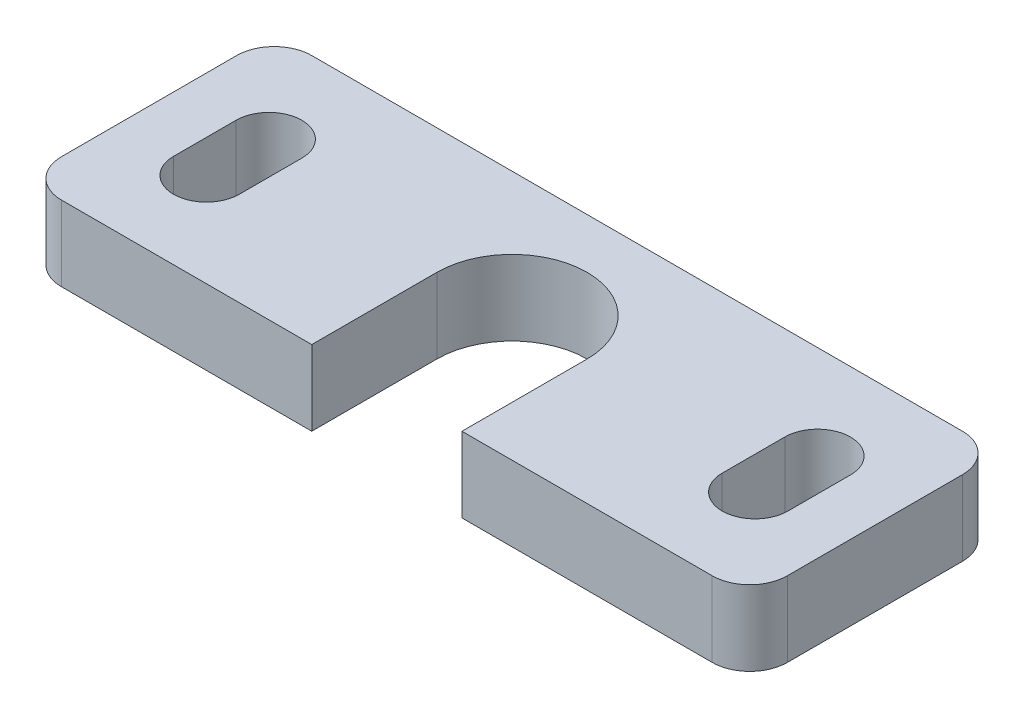
ISO-10303-21;
HEADER;
FILE_DESCRIPTION(('STEP AP214'),'2;1');
FILE_NAME('part.step','',(''),(''),'','','');
FILE_SCHEMA(('AUTOMOTIVE_DESIGN { 1 0 10303 214 1 1 1 1 }'));
ENDSEC;
DATA;
#1=APPLICATION_CONTEXT('core data for automotive mechanical design processes');
#2=APPLICATION_PROTOCOL_DEFINITION('international standard','automotive_design',2000,#1);
#3=PRODUCT_CONTEXT('',#1,'mechanical');
#4=PRODUCT('Part','Part','',(#3));
#5=PRODUCT_RELATED_PRODUCT_CATEGORY('part','',(#4));
#6=PRODUCT_DEFINITION_FORMATION('','',#4);
#7=PRODUCT_DEFINITION_CONTEXT('part definition',#1,'design');
#8=PRODUCT_DEFINITION('design','',#6,#7);
#9=PRODUCT_DEFINITION_SHAPE('','',#8);
#10=(LENGTH_UNIT() NAMED_UNIT(*) SI_UNIT(.MILLI.,.METRE.));
#11=(NAMED_UNIT(*) PLANE_ANGLE_UNIT() SI_UNIT($,.RADIAN.));
#12=(NAMED_UNIT(*) SI_UNIT($,.STERADIAN.) SOLID_ANGLE_UNIT());
#13=UNCERTAINTY_MEASURE_WITH_UNIT(LENGTH_MEASURE(1.E-05),#10,'distance_accuracy_value','');
#14=(GEOMETRIC_REPRESENTATION_CONTEXT(3) GLOBAL_UNCERTAINTY_ASSIGNED_CONTEXT((#13)) GLOBAL_UNIT_ASSIGNED_CONTEXT((#10,
#11,#12)) REPRESENTATION_CONTEXT('',''));
#15=CARTESIAN_POINT('',(0.,0.,0.));
#16=DIRECTION('',(0.,0.,1.));
#17=DIRECTION('',(1.,0.,0.));
#18=AXIS2_PLACEMENT_3D('',#15,#16,#17);
#19=CARTESIAN_POINT('',(29.,6.,-10.));
#20=DIRECTION('',(0.,-1.,0.));
#21=DIRECTION('',(0.,0.,-1.));
#22=AXIS2_PLACEMENT_3D('',#19,#20,#21);
#23=PLANE('',#22);
#24=CARTESIAN_POINT('',(7.08,6.,-12.5));
#25=DIRECTION('',(0.,1.,0.));
#26=DIRECTION('',(0.,0.,1.));
#27=AXIS2_PLACEMENT_3D('',#24,#25,#26);
#28=CIRCLE('',#27,2.62499999999999);
#29=CARTESIAN_POINT('',(9.70499999999999,6.,-12.5));
#30=VERTEX_POINT('',#29);
#31=CARTESIAN_POINT('',(4.45500000000001,6.,-12.5));
#32=VERTEX_POINT('',#31);
#33=EDGE_CURVE('E213',#30,#32,#28,.T.);
#34=ORIENTED_EDGE('',*,*,#33,.F.);
#35=DIRECTION('',(0.,0.,-1.));
#36=VECTOR('',#35,1.);
#37=CARTESIAN_POINT('',(9.70499999999999,6.,-12.5));
#38=LINE('',#37,#36);
#39=CARTESIAN_POINT('',(9.70499999999999,6.,-7.5));
#40=VERTEX_POINT('',#39);
#41=EDGE_CURVE('E221',#40,#30,#38,.T.);
#42=ORIENTED_EDGE('',*,*,#41,.F.);
#43=CARTESIAN_POINT('',(7.08,6.,-7.5));
#44=DIRECTION('',(0.,1.,0.));
#45=DIRECTION('',(0.,0.,1.));
#46=AXIS2_PLACEMENT_3D('',#43,#44,#45);
#47=CIRCLE('',#46,2.62499999999999);
#48=CARTESIAN_POINT('',(4.45500000000001,6.,-7.50000000000001));
#49=VERTEX_POINT('',#48);
#50=EDGE_CURVE('E218',#49,#40,#47,.T.);
#51=ORIENTED_EDGE('',*,*,#50,.F.);
#52=DIRECTION('',(0.,0.,1.));
#53=VECTOR('',#52,1.);
#54=CARTESIAN_POINT('',(4.45500000000001,6.,-12.5));
#55=LINE('',#54,#53);
#56=EDGE_CURVE('E215',#32,#49,#55,.T.);
#57=ORIENTED_EDGE('',*,*,#56,.F.);
#58=EDGE_LOOP('',(#34,#42,#51,#57));
#59=FACE_BOUND('',#58,.T.);
#60=DIRECTION('',(-1.,0.,0.));
#61=VECTOR('',#60,1.);
#62=CARTESIAN_POINT('',(0.,6.,-20.));
#63=LINE('',#62,#61);
#64=CARTESIAN_POINT('',(55.,6.,-20.));
#65=VERTEX_POINT('',#64);
#66=CARTESIAN_POINT('',(3.,6.,-20.));
#67=VERTEX_POINT('',#66);
#68=EDGE_CURVE('E260',#65,#67,#63,.T.);
#69=ORIENTED_EDGE('',*,*,#68,.T.);
#70=CARTESIAN_POINT('',(3.,6.,-17.));
#71=DIRECTION('',(0.,-1.,0.));
#72=DIRECTION('',(0.,0.,-1.));
#73=AXIS2_PLACEMENT_3D('',#70,#71,#72);
#74=CIRCLE('',#73,3.);
#75=CARTESIAN_POINT('',(0.,6.,-17.));
#76=VERTEX_POINT('',#75);
#77=EDGE_CURVE('E315',#67,#76,#74,.F.);
#78=ORIENTED_EDGE('',*,*,#77,.T.);
#79=DIRECTION('',(0.,0.,1.));
#80=VECTOR('',#79,1.);
#81=CARTESIAN_POINT('',(0.,6.,0.));
#82=LINE('',#81,#80);
#83=CARTESIAN_POINT('',(0.,6.,-3.));
#84=VERTEX_POINT('',#83);
#85=EDGE_CURVE('E244',#76,#84,#82,.T.);
#86=ORIENTED_EDGE('',*,*,#85,.T.);
#87=CARTESIAN_POINT('',(3.,6.,-3.));
#88=DIRECTION('',(0.,-1.,0.));
#89=DIRECTION('',(0.,0.,-1.));
#90=AXIS2_PLACEMENT_3D('',#87,#88,#89);
#91=CIRCLE('',#90,3.);
#92=CARTESIAN_POINT('',(3.,6.,0.));
#93=VERTEX_POINT('',#92);
#94=EDGE_CURVE('E313',#84,#93,#91,.F.);
#95=ORIENTED_EDGE('',*,*,#94,.T.);
#96=DIRECTION('',(1.,0.,0.));
#97=VECTOR('',#96,1.);
#98=CARTESIAN_POINT('',(0.,6.,0.));
#99=LINE('',#98,#97);
#100=CARTESIAN_POINT('',(23.,6.,0.));
#101=VERTEX_POINT('',#100);
#102=EDGE_CURVE('E247',#93,#101,#99,.T.);
#103=ORIENTED_EDGE('',*,*,#102,.T.);
#104=DIRECTION('',(0.,0.,-1.));
#105=VECTOR('',#104,1.);
#106=CARTESIAN_POINT('',(23.,6.,0.));
#107=LINE('',#106,#105);
#108=CARTESIAN_POINT('',(23.,6.,-10.));
#109=VERTEX_POINT('',#108);
#110=EDGE_CURVE('E250',#101,#109,#107,.T.);
#111=ORIENTED_EDGE('',*,*,#110,.T.);
#112=CARTESIAN_POINT('',(29.,6.,-10.));
#113=DIRECTION('',(0.,-1.,0.));
#114=DIRECTION('',(0.,0.,-1.));
#115=AXIS2_PLACEMENT_3D('',#112,#113,#114);
#116=CIRCLE('',#115,6.);
#117=CARTESIAN_POINT('',(35.,6.,-10.));
#118=VERTEX_POINT('',#117);
#119=EDGE_CURVE('E252',#109,#118,#116,.T.);
#120=ORIENTED_EDGE('',*,*,#119,.T.);
#121=DIRECTION('',(0.,0.,1.));
#122=VECTOR('',#121,1.);
#123=CARTESIAN_POINT('',(35.,6.,-10.));
#124=LINE('',#123,#122);
#125=CARTESIAN_POINT('',(35.,6.,0.));
#126=VERTEX_POINT('',#125);
#127=EDGE_CURVE('E254',#118,#126,#124,.T.);
#128=ORIENTED_EDGE('',*,*,#127,.T.);
#129=DIRECTION('',(1.,0.,0.));
#130=VECTOR('',#129,1.);
#131=CARTESIAN_POINT('',(35.,6.,0.));
#132=LINE('',#131,#130);
#133=CARTESIAN_POINT('',(55.,6.,0.));
#134=VERTEX_POINT('',#133);
#135=EDGE_CURVE('E256',#126,#134,#132,.T.);
#136=ORIENTED_EDGE('',*,*,#135,.T.);
#137=CARTESIAN_POINT('',(55.,6.,-3.));
#138=DIRECTION('',(0.,-1.,0.));
#139=DIRECTION('',(0.,0.,-1.));
#140=AXIS2_PLACEMENT_3D('',#137,#138,#139);
#141=CIRCLE('',#140,3.);
#142=CARTESIAN_POINT('',(58.,6.,-3.));
#143=VERTEX_POINT('',#142);
#144=EDGE_CURVE('E55',#134,#143,#141,.F.);
#145=ORIENTED_EDGE('',*,*,#144,.T.);
#146=DIRECTION('',(0.,0.,-1.));
#147=VECTOR('',#146,1.);
#148=CARTESIAN_POINT('',(58.,6.,0.));
#149=LINE('',#148,#147);
#150=CARTESIAN_POINT('',(58.,6.,-17.));
#151=VERTEX_POINT('',#150);
#152=EDGE_CURVE('E258',#143,#151,#149,.T.);
#153=ORIENTED_EDGE('',*,*,#152,.T.);
#154=CARTESIAN_POINT('',(55.,6.,-17.));
#155=DIRECTION('',(0.,-1.,0.));
#156=DIRECTION('',(0.,0.,-1.));
#157=AXIS2_PLACEMENT_3D('',#154,#155,#156);
#158=CIRCLE('',#157,3.);
#159=EDGE_CURVE('E310',#151,#65,#158,.F.);
#160=ORIENTED_EDGE('',*,*,#159,.T.);
#161=EDGE_LOOP('',(#69,#78,#86,#95,#103,#111,#120,#128,#136,#145,#153,#160));
#162=FACE_BOUND('',#161,.T.);
#163=CARTESIAN_POINT('',(50.92,6.,-12.5));
#164=DIRECTION('',(0.,1.,0.));
#165=DIRECTION('',(0.,0.,-1.));
#166=AXIS2_PLACEMENT_3D('',#163,#164,#165);
#167=CIRCLE('',#166,2.62499999999999);
#168=CARTESIAN_POINT('',(53.545,6.,-12.5));
#169=VERTEX_POINT('',#168);
#170=CARTESIAN_POINT('',(48.295,6.,-12.5));
#171=VERTEX_POINT('',#170);
#172=EDGE_CURVE('E172',#169,#171,#167,.T.);
#173=ORIENTED_EDGE('',*,*,#172,.F.);
#174=DIRECTION('',(0.,0.,-1.));
#175=VECTOR('',#174,1.);
#176=CARTESIAN_POINT('',(53.545,6.,-12.5));
#177=LINE('',#176,#175);
#178=CARTESIAN_POINT('',(53.545,6.,-7.50000000000002));
#179=VERTEX_POINT('',#178);
#180=EDGE_CURVE('E197',#179,#169,#177,.T.);
#181=ORIENTED_EDGE('',*,*,#180,.F.);
#182=CARTESIAN_POINT('',(50.92,6.,-7.50000000000002));
#183=DIRECTION('',(0.,1.,0.));
#184=DIRECTION('',(0.,0.,-1.));
#185=AXIS2_PLACEMENT_3D('',#182,#183,#184);
#186=CIRCLE('',#185,2.62499999999999);
#187=CARTESIAN_POINT('',(48.295,6.,-7.50000000000002));
#188=VERTEX_POINT('',#187);
#189=EDGE_CURVE('E195',#188,#179,#186,.T.);
#190=ORIENTED_EDGE('',*,*,#189,.F.);
#191=DIRECTION('',(0.,0.,1.));
#192=VECTOR('',#191,1.);
#193=CARTESIAN_POINT('',(48.295,6.,-12.5));
#194=LINE('',#193,#192);
#195=EDGE_CURVE('E182',#171,#188,#194,.T.);
#196=ORIENTED_EDGE('',*,*,#195,.F.);
#197=EDGE_LOOP('',(#173,#181,#190,#196));
#198=FACE_BOUND('',#197,.T.);
#199=ADVANCED_FACE('F33',(#59,#162,#198),#23,.F.);
#200=CARTESIAN_POINT('',(29.,0.,-10.));
#201=DIRECTION('',(0.,-1.,0.));
#202=DIRECTION('',(0.,0.,-1.));
#203=AXIS2_PLACEMENT_3D('',#200,#201,#202);
#204=PLANE('',#203);
#205=DIRECTION('',(0.,0.,1.));
#206=VECTOR('',#205,1.);
#207=CARTESIAN_POINT('',(0.,0.,0.));
#208=LINE('',#207,#206);
#209=CARTESIAN_POINT('',(0.,0.,-17.));
#210=VERTEX_POINT('',#209);
#211=CARTESIAN_POINT('',(0.,0.,-3.));
#212=VERTEX_POINT('',#211);
#213=EDGE_CURVE('E243',#210,#212,#208,.T.);
#214=ORIENTED_EDGE('',*,*,#213,.F.);
#215=CARTESIAN_POINT('',(3.,0.,-17.));
#216=DIRECTION('',(0.,-1.,0.));
#217=DIRECTION('',(0.,0.,-1.));
#218=AXIS2_PLACEMENT_3D('',#215,#216,#217);
#219=CIRCLE('',#218,3.);
#220=CARTESIAN_POINT('',(3.,0.,-20.));
#221=VERTEX_POINT('',#220);
#222=EDGE_CURVE('E303',#210,#221,#219,.T.);
#223=ORIENTED_EDGE('',*,*,#222,.T.);
#224=DIRECTION('',(-1.,0.,0.));
#225=VECTOR('',#224,1.);
#226=CARTESIAN_POINT('',(0.,0.,-20.));
#227=LINE('',#226,#225);
#228=CARTESIAN_POINT('',(55.,0.,-20.));
#229=VERTEX_POINT('',#228);
#230=EDGE_CURVE('E248',#229,#221,#227,.T.);
#231=ORIENTED_EDGE('',*,*,#230,.F.);
#232=CARTESIAN_POINT('',(55.,0.,-17.));
#233=DIRECTION('',(0.,-1.,0.));
#234=DIRECTION('',(0.,0.,-1.));
#235=AXIS2_PLACEMENT_3D('',#232,#233,#234);
#236=CIRCLE('',#235,3.);
#237=CARTESIAN_POINT('',(58.,0.,-17.));
#238=VERTEX_POINT('',#237);
#239=EDGE_CURVE('E297',#229,#238,#236,.T.);
#240=ORIENTED_EDGE('',*,*,#239,.T.);
#241=DIRECTION('',(0.,0.,-1.));
#242=VECTOR('',#241,1.);
#243=CARTESIAN_POINT('',(58.,0.,0.));
#244=LINE('',#243,#242);
#245=CARTESIAN_POINT('',(58.,0.,-3.));
#246=VERTEX_POINT('',#245);
#247=EDGE_CURVE('E277',#246,#238,#244,.T.);
#248=ORIENTED_EDGE('',*,*,#247,.F.);
#249=CARTESIAN_POINT('',(55.,0.,-3.));
#250=DIRECTION('',(0.,-1.,0.));
#251=DIRECTION('',(0.,0.,-1.));
#252=AXIS2_PLACEMENT_3D('',#249,#250,#251);
#253=CIRCLE('',#252,3.);
#254=CARTESIAN_POINT('',(55.,0.,0.));
#255=VERTEX_POINT('',#254);
#256=EDGE_CURVE('E299',#246,#255,#253,.T.);
#257=ORIENTED_EDGE('',*,*,#256,.T.);
#258=DIRECTION('',(1.,0.,0.));
#259=VECTOR('',#258,1.);
#260=CARTESIAN_POINT('',(35.,0.,0.));
#261=LINE('',#260,#259);
#262=CARTESIAN_POINT('',(35.,0.,0.));
#263=VERTEX_POINT('',#262);
#264=EDGE_CURVE('E274',#263,#255,#261,.T.);
#265=ORIENTED_EDGE('',*,*,#264,.F.);
#266=DIRECTION('',(0.,0.,1.));
#267=VECTOR('',#266,1.);
#268=CARTESIAN_POINT('',(35.,0.,-10.));
#269=LINE('',#268,#267);
#270=CARTESIAN_POINT('',(35.,0.,-10.));
#271=VERTEX_POINT('',#270);
#272=EDGE_CURVE('E272',#271,#263,#269,.T.);
#273=ORIENTED_EDGE('',*,*,#272,.F.);
#274=CARTESIAN_POINT('',(29.,0.,-10.));
#275=DIRECTION('',(0.,-1.,0.));
#276=DIRECTION('',(0.,0.,-1.));
#277=AXIS2_PLACEMENT_3D('',#274,#275,#276);
#278=CIRCLE('',#277,6.);
#279=CARTESIAN_POINT('',(23.,0.,-10.));
#280=VERTEX_POINT('',#279);
#281=EDGE_CURVE('E270',#280,#271,#278,.T.);
#282=ORIENTED_EDGE('',*,*,#281,.F.);
#283=DIRECTION('',(0.,0.,-1.));
#284=VECTOR('',#283,1.);
#285=CARTESIAN_POINT('',(23.,0.,0.));
#286=LINE('',#285,#284);
#287=CARTESIAN_POINT('',(23.,0.,0.));
#288=VERTEX_POINT('',#287);
#289=EDGE_CURVE('E268',#288,#280,#286,.T.);
#290=ORIENTED_EDGE('',*,*,#289,.F.);
#291=DIRECTION('',(1.,0.,0.));
#292=VECTOR('',#291,1.);
#293=CARTESIAN_POINT('',(0.,0.,0.));
#294=LINE('',#293,#292);
#295=CARTESIAN_POINT('',(3.,0.,0.));
#296=VERTEX_POINT('',#295);
#297=EDGE_CURVE('E266',#296,#288,#294,.T.);
#298=ORIENTED_EDGE('',*,*,#297,.F.);
#299=CARTESIAN_POINT('',(3.,0.,-3.));
#300=DIRECTION('',(0.,-1.,0.));
#301=DIRECTION('',(0.,0.,-1.));
#302=AXIS2_PLACEMENT_3D('',#299,#300,#301);
#303=CIRCLE('',#302,3.);
#304=EDGE_CURVE('E301',#296,#212,#303,.T.);
#305=ORIENTED_EDGE('',*,*,#304,.T.);
#306=EDGE_LOOP('',(#214,#223,#231,#240,#248,#257,#265,#273,#282,#290,#298,#305));
#307=FACE_BOUND('',#306,.T.);
#308=DIRECTION('',(0.,0.,-1.));
#309=VECTOR('',#308,1.);
#310=CARTESIAN_POINT('',(9.70499999999999,0.,-12.5));
#311=LINE('',#310,#309);
#312=CARTESIAN_POINT('',(9.70499999999999,0.,-7.5));
#313=VERTEX_POINT('',#312);
#314=CARTESIAN_POINT('',(9.70499999999999,0.,-12.5));
#315=VERTEX_POINT('',#314);
#316=EDGE_CURVE('E216',#313,#315,#311,.T.);
#317=ORIENTED_EDGE('',*,*,#316,.T.);
#318=CARTESIAN_POINT('',(7.08,0.,-12.5));
#319=DIRECTION('',(0.,1.,0.));
#320=DIRECTION('',(0.,0.,1.));
#321=AXIS2_PLACEMENT_3D('',#318,#319,#320);
#322=CIRCLE('',#321,2.62499999999999);
#323=CARTESIAN_POINT('',(4.45500000000001,0.,-12.5));
#324=VERTEX_POINT('',#323);
#325=EDGE_CURVE('E190',#315,#324,#322,.T.);
#326=ORIENTED_EDGE('',*,*,#325,.T.);
#327=DIRECTION('',(0.,0.,1.));
#328=VECTOR('',#327,1.);
#329=CARTESIAN_POINT('',(4.45500000000001,0.,-12.5));
#330=LINE('',#329,#328);
#331=CARTESIAN_POINT('',(4.45500000000001,0.,-7.50000000000001));
#332=VERTEX_POINT('',#331);
#333=EDGE_CURVE('E226',#324,#332,#330,.T.);
#334=ORIENTED_EDGE('',*,*,#333,.T.);
#335=CARTESIAN_POINT('',(7.08,0.,-7.5));
#336=DIRECTION('',(0.,1.,0.));
#337=DIRECTION('',(0.,0.,1.));
#338=AXIS2_PLACEMENT_3D('',#335,#336,#337);
#339=CIRCLE('',#338,2.62499999999999);
#340=EDGE_CURVE('E229',#332,#313,#339,.T.);
#341=ORIENTED_EDGE('',*,*,#340,.T.);
#342=EDGE_LOOP('',(#317,#326,#334,#341));
#343=FACE_BOUND('',#342,.T.);
#344=DIRECTION('',(0.,0.,-1.));
#345=VECTOR('',#344,1.);
#346=CARTESIAN_POINT('',(53.545,0.,-12.5));
#347=LINE('',#346,#345);
#348=CARTESIAN_POINT('',(53.545,0.,-7.50000000000002));
#349=VERTEX_POINT('',#348);
#350=CARTESIAN_POINT('',(53.545,0.,-12.5));
#351=VERTEX_POINT('',#350);
#352=EDGE_CURVE('E183',#349,#351,#347,.T.);
#353=ORIENTED_EDGE('',*,*,#352,.T.);
#354=CARTESIAN_POINT('',(50.92,0.,-12.5));
#355=DIRECTION('',(0.,1.,0.));
#356=DIRECTION('',(0.,0.,-1.));
#357=AXIS2_PLACEMENT_3D('',#354,#355,#356);
#358=CIRCLE('',#357,2.62499999999999);
#359=CARTESIAN_POINT('',(48.295,0.,-12.5));
#360=VERTEX_POINT('',#359);
#361=EDGE_CURVE('E201',#351,#360,#358,.T.);
#362=ORIENTED_EDGE('',*,*,#361,.T.);
#363=DIRECTION('',(0.,0.,1.));
#364=VECTOR('',#363,1.);
#365=CARTESIAN_POINT('',(48.295,0.,-12.5));
#366=LINE('',#365,#364);
#367=CARTESIAN_POINT('',(48.295,0.,-7.50000000000002));
#368=VERTEX_POINT('',#367);
#369=EDGE_CURVE('E189',#360,#368,#366,.T.);
#370=ORIENTED_EDGE('',*,*,#369,.T.);
#371=CARTESIAN_POINT('',(50.92,0.,-7.50000000000002));
#372=DIRECTION('',(0.,1.,0.));
#373=DIRECTION('',(0.,0.,-1.));
#374=AXIS2_PLACEMENT_3D('',#371,#372,#373);
#375=CIRCLE('',#374,2.62499999999999);
#376=EDGE_CURVE('E204',#368,#349,#375,.T.);
#377=ORIENTED_EDGE('',*,*,#376,.T.);
#378=EDGE_LOOP('',(#353,#362,#370,#377));
#379=FACE_BOUND('',#378,.T.);
#380=ADVANCED_FACE('F327',(#307,#343,#379),#204,.T.);
#381=CARTESIAN_POINT('',(0.,6.,0.));
#382=DIRECTION('',(1.,0.,0.));
#383=DIRECTION('',(0.,0.,-1.));
#384=AXIS2_PLACEMENT_3D('',#381,#382,#383);
#385=PLANE('',#384);
#386=ORIENTED_EDGE('',*,*,#85,.F.);
#387=DIRECTION('',(0.,-1.,0.));
#388=VECTOR('',#387,1.);
#389=CARTESIAN_POINT('',(0.,6.,-17.));
#390=LINE('',#389,#388);
#391=EDGE_CURVE('E294',#76,#210,#390,.T.);
#392=ORIENTED_EDGE('',*,*,#391,.T.);
#393=ORIENTED_EDGE('',*,*,#213,.T.);
#394=DIRECTION('',(0.,-1.,0.));
#395=VECTOR('',#394,1.);
#396=CARTESIAN_POINT('',(0.,6.,-3.));
#397=LINE('',#396,#395);
#398=EDGE_CURVE('E292',#212,#84,#397,.F.);
#399=ORIENTED_EDGE('',*,*,#398,.T.);
#400=EDGE_LOOP('',(#386,#392,#393,#399));
#401=FACE_BOUND('',#400,.T.);
#402=ADVANCED_FACE('F344',(#401),#385,.F.);
#403=CARTESIAN_POINT('',(0.,6.,0.));
#404=DIRECTION('',(0.,0.,-1.));
#405=DIRECTION('',(-1.,0.,0.));
#406=AXIS2_PLACEMENT_3D('',#403,#404,#405);
#407=PLANE('',#406);
#408=ORIENTED_EDGE('',*,*,#102,.F.);
#409=DIRECTION('',(0.,-1.,0.));
#410=VECTOR('',#409,1.);
#411=CARTESIAN_POINT('',(3.,6.,0.));
#412=LINE('',#411,#410);
#413=EDGE_CURVE('E317',#93,#296,#412,.T.);
#414=ORIENTED_EDGE('',*,*,#413,.T.);
#415=ORIENTED_EDGE('',*,*,#297,.T.);
#416=DIRECTION('',(0.,-1.,0.));
#417=VECTOR('',#416,1.);
#418=CARTESIAN_POINT('',(23.,6.,0.));
#419=LINE('',#418,#417);
#420=EDGE_CURVE('E289',#101,#288,#419,.T.);
#421=ORIENTED_EDGE('',*,*,#420,.F.);
#422=EDGE_LOOP('',(#408,#414,#415,#421));
#423=FACE_BOUND('',#422,.T.);
#424=ADVANCED_FACE('F354',(#423),#407,.F.);
#425=CARTESIAN_POINT('',(23.,6.,0.));
#426=DIRECTION('',(-1.,0.,0.));
#427=DIRECTION('',(0.,0.,1.));
#428=AXIS2_PLACEMENT_3D('',#425,#426,#427);
#429=PLANE('',#428);
#430=ORIENTED_EDGE('',*,*,#289,.T.);
#431=DIRECTION('',(0.,-1.,0.));
#432=VECTOR('',#431,1.);
#433=CARTESIAN_POINT('',(23.,6.,-10.));
#434=LINE('',#433,#432);
#435=EDGE_CURVE('E286',#109,#280,#434,.T.);
#436=ORIENTED_EDGE('',*,*,#435,.F.);
#437=ORIENTED_EDGE('',*,*,#110,.F.);
#438=ORIENTED_EDGE('',*,*,#420,.T.);
#439=EDGE_LOOP('',(#430,#436,#437,#438));
#440=FACE_BOUND('',#439,.T.);
#441=ADVANCED_FACE('F361',(#440),#429,.F.);
#442=CARTESIAN_POINT('',(29.,6.,-10.));
#443=DIRECTION('',(0.,-1.,0.));
#444=DIRECTION('',(0.,0.,-1.));
#445=AXIS2_PLACEMENT_3D('',#442,#443,#444);
#446=CYLINDRICAL_SURFACE('',#445,6.);
#447=ORIENTED_EDGE('',*,*,#281,.T.);
#448=DIRECTION('',(0.,-1.,0.));
#449=VECTOR('',#448,1.);
#450=CARTESIAN_POINT('',(35.,6.,-10.));
#451=LINE('',#450,#449);
#452=EDGE_CURVE('E283',#118,#271,#451,.T.);
#453=ORIENTED_EDGE('',*,*,#452,.F.);
#454=ORIENTED_EDGE('',*,*,#119,.F.);
#455=ORIENTED_EDGE('',*,*,#435,.T.);
#456=EDGE_LOOP('',(#447,#453,#454,#455));
#457=FACE_BOUND('',#456,.T.);
#458=ADVANCED_FACE('F364',(#457),#446,.F.);
#459=CARTESIAN_POINT('',(35.,6.,-10.));
#460=DIRECTION('',(1.,0.,0.));
#461=DIRECTION('',(0.,0.,-1.));
#462=AXIS2_PLACEMENT_3D('',#459,#460,#461);
#463=PLANE('',#462);
#464=ORIENTED_EDGE('',*,*,#272,.T.);
#465=DIRECTION('',(0.,-1.,0.));
#466=VECTOR('',#465,1.);
#467=CARTESIAN_POINT('',(35.,6.,0.));
#468=LINE('',#467,#466);
#469=EDGE_CURVE('E263',#126,#263,#468,.T.);
#470=ORIENTED_EDGE('',*,*,#469,.F.);
#471=ORIENTED_EDGE('',*,*,#127,.F.);
#472=ORIENTED_EDGE('',*,*,#452,.T.);
#473=EDGE_LOOP('',(#464,#470,#471,#472));
#474=FACE_BOUND('',#473,.T.);
#475=ADVANCED_FACE('F369',(#474),#463,.F.);
#476=CARTESIAN_POINT('',(35.,6.,0.));
#477=DIRECTION('',(0.,0.,-1.));
#478=DIRECTION('',(-1.,0.,0.));
#479=AXIS2_PLACEMENT_3D('',#476,#477,#478);
#480=PLANE('',#479);
#481=ORIENTED_EDGE('',*,*,#264,.T.);
#482=DIRECTION('',(0.,-1.,0.));
#483=VECTOR('',#482,1.);
#484=CARTESIAN_POINT('',(55.,6.,0.));
#485=LINE('',#484,#483);
#486=EDGE_CURVE('E11',#255,#134,#485,.F.);
#487=ORIENTED_EDGE('',*,*,#486,.T.);
#488=ORIENTED_EDGE('',*,*,#135,.F.);
#489=ORIENTED_EDGE('',*,*,#469,.T.);
#490=EDGE_LOOP('',(#481,#487,#488,#489));
#491=FACE_BOUND('',#490,.T.);
#492=ADVANCED_FACE('F374',(#491),#480,.F.);
#493=CARTESIAN_POINT('',(58.,6.,0.));
#494=DIRECTION('',(-1.,0.,0.));
#495=DIRECTION('',(0.,0.,1.));
#496=AXIS2_PLACEMENT_3D('',#493,#494,#495);
#497=PLANE('',#496);
#498=ORIENTED_EDGE('',*,*,#152,.F.);
#499=DIRECTION('',(0.,-1.,0.));
#500=VECTOR('',#499,1.);
#501=CARTESIAN_POINT('',(58.,6.,-3.));
#502=LINE('',#501,#500);
#503=EDGE_CURVE('E41',#143,#246,#502,.T.);
#504=ORIENTED_EDGE('',*,*,#503,.T.);
#505=ORIENTED_EDGE('',*,*,#247,.T.);
#506=DIRECTION('',(0.,-1.,0.));
#507=VECTOR('',#506,1.);
#508=CARTESIAN_POINT('',(58.,6.,-17.));
#509=LINE('',#508,#507);
#510=EDGE_CURVE('E48',#238,#151,#509,.F.);
#511=ORIENTED_EDGE('',*,*,#510,.T.);
#512=EDGE_LOOP('',(#498,#504,#505,#511));
#513=FACE_BOUND('',#512,.T.);
#514=ADVANCED_FACE('F323',(#513),#497,.F.);
#515=CARTESIAN_POINT('',(0.,6.,-20.));
#516=DIRECTION('',(0.,0.,1.));
#517=DIRECTION('',(1.,0.,0.));
#518=AXIS2_PLACEMENT_3D('',#515,#516,#517);
#519=PLANE('',#518);
#520=ORIENTED_EDGE('',*,*,#230,.T.);
#521=DIRECTION('',(0.,-1.,0.));
#522=VECTOR('',#521,1.);
#523=CARTESIAN_POINT('',(3.,6.,-20.));
#524=LINE('',#523,#522);
#525=EDGE_CURVE('E308',#221,#67,#524,.F.);
#526=ORIENTED_EDGE('',*,*,#525,.T.);
#527=ORIENTED_EDGE('',*,*,#68,.F.);
#528=DIRECTION('',(0.,-1.,0.));
#529=VECTOR('',#528,1.);
#530=CARTESIAN_POINT('',(55.,6.,-20.));
#531=LINE('',#530,#529);
#532=EDGE_CURVE('E305',#65,#229,#531,.T.);
#533=ORIENTED_EDGE('',*,*,#532,.T.);
#534=EDGE_LOOP('',(#520,#526,#527,#533));
#535=FACE_BOUND('',#534,.T.);
#536=ADVANCED_FACE('F336',(#535),#519,.F.);
#537=CARTESIAN_POINT('',(7.08,6.,-12.5));
#538=DIRECTION('',(0.,-1.,0.));
#539=DIRECTION('',(0.,0.,-1.));
#540=AXIS2_PLACEMENT_3D('',#537,#538,#539);
#541=CYLINDRICAL_SURFACE('',#540,2.62499999999999);
#542=ORIENTED_EDGE('',*,*,#325,.F.);
#543=DIRECTION('',(0.,-1.,0.));
#544=VECTOR('',#543,1.);
#545=CARTESIAN_POINT('',(9.70499999999999,6.,-12.5));
#546=LINE('',#545,#544);
#547=EDGE_CURVE('E223',#30,#315,#546,.T.);
#548=ORIENTED_EDGE('',*,*,#547,.F.);
#549=ORIENTED_EDGE('',*,*,#33,.T.);
#550=DIRECTION('',(0.,-1.,0.));
#551=VECTOR('',#550,1.);
#552=CARTESIAN_POINT('',(4.45500000000001,6.,-12.5));
#553=LINE('',#552,#551);
#554=EDGE_CURVE('E240',#32,#324,#553,.T.);
#555=ORIENTED_EDGE('',*,*,#554,.T.);
#556=EDGE_LOOP('',(#542,#548,#549,#555));
#557=FACE_BOUND('',#556,.T.);
#558=ADVANCED_FACE('F392',(#557),#541,.F.);
#559=CARTESIAN_POINT('',(4.45500000000001,6.,-12.5));
#560=DIRECTION('',(1.,0.,0.));
#561=DIRECTION('',(0.,0.,-1.));
#562=AXIS2_PLACEMENT_3D('',#559,#560,#561);
#563=PLANE('',#562);
#564=ORIENTED_EDGE('',*,*,#333,.F.);
#565=ORIENTED_EDGE('',*,*,#554,.F.);
#566=ORIENTED_EDGE('',*,*,#56,.T.);
#567=DIRECTION('',(0.,-1.,0.));
#568=VECTOR('',#567,1.);
#569=CARTESIAN_POINT('',(4.45500000000001,6.,-7.50000000000001));
#570=LINE('',#569,#568);
#571=EDGE_CURVE('E238',#49,#332,#570,.T.);
#572=ORIENTED_EDGE('',*,*,#571,.T.);
#573=EDGE_LOOP('',(#564,#565,#566,#572));
#574=FACE_BOUND('',#573,.T.);
#575=ADVANCED_FACE('F399',(#574),#563,.T.);
#576=CARTESIAN_POINT('',(7.08,6.,-7.5));
#577=DIRECTION('',(0.,-1.,0.));
#578=DIRECTION('',(0.,0.,-1.));
#579=AXIS2_PLACEMENT_3D('',#576,#577,#578);
#580=CYLINDRICAL_SURFACE('',#579,2.62499999999999);
#581=ORIENTED_EDGE('',*,*,#340,.F.);
#582=ORIENTED_EDGE('',*,*,#571,.F.);
#583=ORIENTED_EDGE('',*,*,#50,.T.);
#584=DIRECTION('',(0.,-1.,0.));
#585=VECTOR('',#584,1.);
#586=CARTESIAN_POINT('',(9.70499999999999,6.,-7.5));
#587=LINE('',#586,#585);
#588=EDGE_CURVE('E236',#40,#313,#587,.T.);
#589=ORIENTED_EDGE('',*,*,#588,.T.);
#590=EDGE_LOOP('',(#581,#582,#583,#589));
#591=FACE_BOUND('',#590,.T.);
#592=ADVANCED_FACE('F404',(#591),#580,.F.);
#593=CARTESIAN_POINT('',(9.70499999999999,6.,-12.5));
#594=DIRECTION('',(-1.,0.,0.));
#595=DIRECTION('',(0.,0.,1.));
#596=AXIS2_PLACEMENT_3D('',#593,#594,#595);
#597=PLANE('',#596);
#598=ORIENTED_EDGE('',*,*,#316,.F.);
#599=ORIENTED_EDGE('',*,*,#588,.F.);
#600=ORIENTED_EDGE('',*,*,#41,.T.);
#601=ORIENTED_EDGE('',*,*,#547,.T.);
#602=EDGE_LOOP('',(#598,#599,#600,#601));
#603=FACE_BOUND('',#602,.T.);
#604=ADVANCED_FACE('F410',(#603),#597,.T.);
#605=CARTESIAN_POINT('',(50.92,6.,-12.5));
#606=DIRECTION('',(0.,-1.,0.));
#607=DIRECTION('',(0.,0.,-1.));
#608=AXIS2_PLACEMENT_3D('',#605,#606,#607);
#609=CYLINDRICAL_SURFACE('',#608,2.62499999999999);
#610=ORIENTED_EDGE('',*,*,#361,.F.);
#611=DIRECTION('',(0.,-1.,0.));
#612=VECTOR('',#611,1.);
#613=CARTESIAN_POINT('',(53.545,6.,-12.5));
#614=LINE('',#613,#612);
#615=EDGE_CURVE('E178',#169,#351,#614,.T.);
#616=ORIENTED_EDGE('',*,*,#615,.F.);
#617=ORIENTED_EDGE('',*,*,#172,.T.);
#618=DIRECTION('',(0.,-1.,0.));
#619=VECTOR('',#618,1.);
#620=CARTESIAN_POINT('',(48.295,6.,-12.5));
#621=LINE('',#620,#619);
#622=EDGE_CURVE('E175',#171,#360,#621,.T.);
#623=ORIENTED_EDGE('',*,*,#622,.T.);
#624=EDGE_LOOP('',(#610,#616,#617,#623));
#625=FACE_BOUND('',#624,.T.);
#626=ADVANCED_FACE('F174',(#625),#609,.F.);
#627=CARTESIAN_POINT('',(48.295,6.,-12.5));
#628=DIRECTION('',(1.,0.,0.));
#629=DIRECTION('',(0.,0.,-1.));
#630=AXIS2_PLACEMENT_3D('',#627,#628,#629);
#631=PLANE('',#630);
#632=ORIENTED_EDGE('',*,*,#369,.F.);
#633=ORIENTED_EDGE('',*,*,#622,.F.);
#634=ORIENTED_EDGE('',*,*,#195,.T.);
#635=DIRECTION('',(0.,-1.,0.));
#636=VECTOR('',#635,1.);
#637=CARTESIAN_POINT('',(48.295,6.,-7.50000000000002));
#638=LINE('',#637,#636);
#639=EDGE_CURVE('E191',#188,#368,#638,.T.);
#640=ORIENTED_EDGE('',*,*,#639,.T.);
#641=EDGE_LOOP('',(#632,#633,#634,#640));
#642=FACE_BOUND('',#641,.T.);
#643=ADVANCED_FACE('F186',(#642),#631,.T.);
#644=CARTESIAN_POINT('',(50.92,6.,-7.50000000000002));
#645=DIRECTION('',(0.,-1.,0.));
#646=DIRECTION('',(0.,0.,-1.));
#647=AXIS2_PLACEMENT_3D('',#644,#645,#646);
#648=CYLINDRICAL_SURFACE('',#647,2.62499999999999);
#649=ORIENTED_EDGE('',*,*,#376,.F.);
#650=ORIENTED_EDGE('',*,*,#639,.F.);
#651=ORIENTED_EDGE('',*,*,#189,.T.);
#652=DIRECTION('',(0.,-1.,0.));
#653=VECTOR('',#652,1.);
#654=CARTESIAN_POINT('',(53.545,6.,-7.50000000000002));
#655=LINE('',#654,#653);
#656=EDGE_CURVE('E210',#179,#349,#655,.T.);
#657=ORIENTED_EDGE('',*,*,#656,.T.);
#658=EDGE_LOOP('',(#649,#650,#651,#657));
#659=FACE_BOUND('',#658,.T.);
#660=ADVANCED_FACE('F429',(#659),#648,.F.);
#661=CARTESIAN_POINT('',(53.545,6.,-12.5));
#662=DIRECTION('',(-1.,0.,0.));
#663=DIRECTION('',(0.,0.,1.));
#664=AXIS2_PLACEMENT_3D('',#661,#662,#663);
#665=PLANE('',#664);
#666=ORIENTED_EDGE('',*,*,#352,.F.);
#667=ORIENTED_EDGE('',*,*,#656,.F.);
#668=ORIENTED_EDGE('',*,*,#180,.T.);
#669=ORIENTED_EDGE('',*,*,#615,.T.);
#670=EDGE_LOOP('',(#666,#667,#668,#669));
#671=FACE_BOUND('',#670,.T.);
#672=ADVANCED_FACE('F432',(#671),#665,.T.);
#673=CARTESIAN_POINT('',(3.,6.,-17.));
#674=DIRECTION('',(0.,-1.,0.));
#675=DIRECTION('',(0.,0.,-1.));
#676=AXIS2_PLACEMENT_3D('',#673,#674,#675);
#677=CYLINDRICAL_SURFACE('',#676,3.);
#678=ORIENTED_EDGE('',*,*,#77,.F.);
#679=ORIENTED_EDGE('',*,*,#525,.F.);
#680=ORIENTED_EDGE('',*,*,#222,.F.);
#681=ORIENTED_EDGE('',*,*,#391,.F.);
#682=EDGE_LOOP('',(#678,#679,#680,#681));
#683=FACE_BOUND('',#682,.T.);
#684=ADVANCED_FACE('F342',(#683),#677,.T.);
#685=CARTESIAN_POINT('',(3.,6.,-3.));
#686=DIRECTION('',(0.,-1.,0.));
#687=DIRECTION('',(0.,0.,-1.));
#688=AXIS2_PLACEMENT_3D('',#685,#686,#687);
#689=CYLINDRICAL_SURFACE('',#688,3.);
#690=ORIENTED_EDGE('',*,*,#94,.F.);
#691=ORIENTED_EDGE('',*,*,#398,.F.);
#692=ORIENTED_EDGE('',*,*,#304,.F.);
#693=ORIENTED_EDGE('',*,*,#413,.F.);
#694=EDGE_LOOP('',(#690,#691,#692,#693));
#695=FACE_BOUND('',#694,.T.);
#696=ADVANCED_FACE('F351',(#695),#689,.T.);
#697=CARTESIAN_POINT('',(55.,6.,-3.));
#698=DIRECTION('',(0.,-1.,0.));
#699=DIRECTION('',(0.,0.,-1.));
#700=AXIS2_PLACEMENT_3D('',#697,#698,#699);
#701=CYLINDRICAL_SURFACE('',#700,3.);
#702=ORIENTED_EDGE('',*,*,#144,.F.);
#703=ORIENTED_EDGE('',*,*,#486,.F.);
#704=ORIENTED_EDGE('',*,*,#256,.F.);
#705=ORIENTED_EDGE('',*,*,#503,.F.);
#706=EDGE_LOOP('',(#702,#703,#704,#705));
#707=FACE_BOUND('',#706,.T.);
#708=ADVANCED_FACE('F373',(#707),#701,.T.);
#709=CARTESIAN_POINT('',(55.,6.,-17.));
#710=DIRECTION('',(0.,-1.,0.));
#711=DIRECTION('',(0.,0.,-1.));
#712=AXIS2_PLACEMENT_3D('',#709,#710,#711);
#713=CYLINDRICAL_SURFACE('',#712,3.);
#714=ORIENTED_EDGE('',*,*,#159,.F.);
#715=ORIENTED_EDGE('',*,*,#510,.F.);
#716=ORIENTED_EDGE('',*,*,#239,.F.);
#717=ORIENTED_EDGE('',*,*,#532,.F.);
#718=EDGE_LOOP('',(#714,#715,#716,#717));
#719=FACE_BOUND('',#718,.T.);
#720=ADVANCED_FACE('F35',(#719),#713,.T.);
#721=CLOSED_SHELL('',(#199,#380,#402,#424,#441,#458,#475,#492,#514,#536,#558,#575,#592,#604,
#626,#643,#660,#672,#684,#696,#708,#720));
#722=MANIFOLD_SOLID_BREP('B2',#721);
#723=ADVANCED_BREP_SHAPE_REPRESENTATION('',(#18,#722),#14);
#724=SHAPE_DEFINITION_REPRESENTATION(#9,#723);
ENDSEC;
END-ISO-10303-21;
